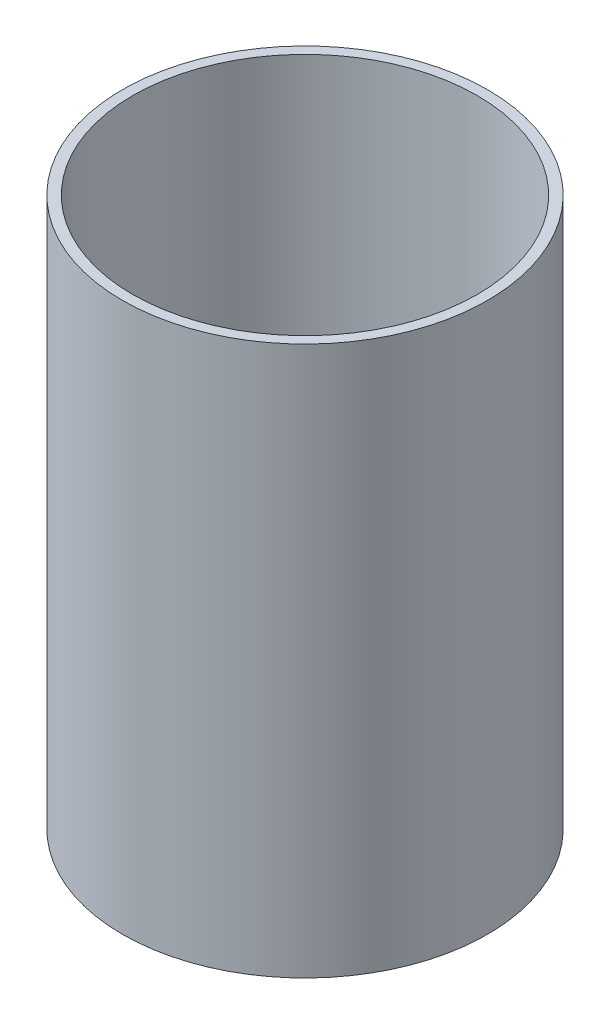
ISO-10303-21;
HEADER;
FILE_DESCRIPTION(('STEP AP214'),'2;1');
FILE_NAME('part.step','',(''),(''),'','','');
FILE_SCHEMA(('AUTOMOTIVE_DESIGN { 1 0 10303 214 1 1 1 1 }'));
ENDSEC;
DATA;
#1=APPLICATION_CONTEXT('core data for automotive mechanical design processes');
#2=APPLICATION_PROTOCOL_DEFINITION('international standard','automotive_design',2000,#1);
#3=PRODUCT_CONTEXT('',#1,'mechanical');
#4=PRODUCT('Part','Part','',(#3));
#5=PRODUCT_RELATED_PRODUCT_CATEGORY('part','',(#4));
#6=PRODUCT_DEFINITION_FORMATION('','',#4);
#7=PRODUCT_DEFINITION_CONTEXT('part definition',#1,'design');
#8=PRODUCT_DEFINITION('design','',#6,#7);
#9=PRODUCT_DEFINITION_SHAPE('','',#8);
#10=(LENGTH_UNIT() NAMED_UNIT(*) SI_UNIT(.MILLI.,.METRE.));
#11=(NAMED_UNIT(*) PLANE_ANGLE_UNIT() SI_UNIT($,.RADIAN.));
#12=(NAMED_UNIT(*) SI_UNIT($,.STERADIAN.) SOLID_ANGLE_UNIT());
#13=UNCERTAINTY_MEASURE_WITH_UNIT(LENGTH_MEASURE(1.E-05),#10,'distance_accuracy_value','');
#14=(GEOMETRIC_REPRESENTATION_CONTEXT(3) GLOBAL_UNCERTAINTY_ASSIGNED_CONTEXT((#13)) GLOBAL_UNIT_ASSIGNED_CONTEXT((#10,
#11,#12)) REPRESENTATION_CONTEXT('',''));
#15=CARTESIAN_POINT('',(0.,0.,0.));
#16=DIRECTION('',(0.,0.,1.));
#17=DIRECTION('',(1.,0.,0.));
#18=AXIS2_PLACEMENT_3D('',#15,#16,#17);
#19=CARTESIAN_POINT('',(0.,76.2,0.));
#20=DIRECTION('',(0.,1.,0.));
#21=DIRECTION('',(0.,0.,1.));
#22=AXIS2_PLACEMENT_3D('',#19,#20,#21);
#23=PLANE('',#22);
#24=CARTESIAN_POINT('',(0.,76.2,0.));
#25=DIRECTION('',(0.,1.,0.));
#26=DIRECTION('',(0.,0.,1.));
#27=AXIS2_PLACEMENT_3D('',#24,#25,#26);
#28=CIRCLE('',#27,25.3365);
#29=CARTESIAN_POINT('',(0.,76.2,25.3365));
#30=VERTEX_POINT('',#29);
#31=EDGE_CURVE('E10',#30,#30,#28,.T.);
#32=ORIENTED_EDGE('',*,*,#31,.T.);
#33=EDGE_LOOP('',(#32));
#34=FACE_BOUND('',#33,.T.);
#35=CARTESIAN_POINT('',(0.,76.2,0.));
#36=DIRECTION('',(0.,1.,0.));
#37=DIRECTION('',(0.,0.,1.));
#38=AXIS2_PLACEMENT_3D('',#35,#36,#37);
#39=CIRCLE('',#38,23.9141);
#40=CARTESIAN_POINT('',(0.,76.2,23.9141));
#41=VERTEX_POINT('',#40);
#42=EDGE_CURVE('E54',#41,#41,#39,.T.);
#43=ORIENTED_EDGE('',*,*,#42,.F.);
#44=EDGE_LOOP('',(#43));
#45=FACE_BOUND('',#44,.T.);
#46=ADVANCED_FACE('F41',(#34,#45),#23,.T.);
#47=CARTESIAN_POINT('',(0.,0.,0.));
#48=DIRECTION('',(0.,1.,0.));
#49=DIRECTION('',(0.,0.,1.));
#50=AXIS2_PLACEMENT_3D('',#47,#48,#49);
#51=PLANE('',#50);
#52=CARTESIAN_POINT('',(0.,0.,0.));
#53=DIRECTION('',(0.,1.,0.));
#54=DIRECTION('',(0.,0.,1.));
#55=AXIS2_PLACEMENT_3D('',#52,#53,#54);
#56=CIRCLE('',#55,25.3365);
#57=CARTESIAN_POINT('',(0.,0.,25.3365));
#58=VERTEX_POINT('',#57);
#59=EDGE_CURVE('E45',#58,#58,#56,.T.);
#60=ORIENTED_EDGE('',*,*,#59,.F.);
#61=EDGE_LOOP('',(#60));
#62=FACE_BOUND('',#61,.T.);
#63=CARTESIAN_POINT('',(0.,0.,0.));
#64=DIRECTION('',(0.,1.,0.));
#65=DIRECTION('',(0.,0.,1.));
#66=AXIS2_PLACEMENT_3D('',#63,#64,#65);
#67=CIRCLE('',#66,23.9141);
#68=CARTESIAN_POINT('',(0.,0.,23.9141));
#69=VERTEX_POINT('',#68);
#70=EDGE_CURVE('E56',#69,#69,#67,.T.);
#71=ORIENTED_EDGE('',*,*,#70,.T.);
#72=EDGE_LOOP('',(#71));
#73=FACE_BOUND('',#72,.T.);
#74=ADVANCED_FACE('F68',(#62,#73),#51,.F.);
#75=CARTESIAN_POINT('',(0.,76.2,0.));
#76=DIRECTION('',(0.,-1.,0.));
#77=DIRECTION('',(0.,0.,-1.));
#78=AXIS2_PLACEMENT_3D('',#75,#76,#77);
#79=CYLINDRICAL_SURFACE('',#78,25.3365);
#80=ORIENTED_EDGE('',*,*,#31,.F.);
#81=EDGE_LOOP('',(#80));
#82=FACE_BOUND('',#81,.T.);
#83=ORIENTED_EDGE('',*,*,#59,.T.);
#84=EDGE_LOOP('',(#83));
#85=FACE_BOUND('',#84,.T.);
#86=ADVANCED_FACE('F43',(#82,#85),#79,.T.);
#87=CARTESIAN_POINT('',(0.,76.2,0.));
#88=DIRECTION('',(0.,-1.,0.));
#89=DIRECTION('',(0.,0.,-1.));
#90=AXIS2_PLACEMENT_3D('',#87,#88,#89);
#91=CYLINDRICAL_SURFACE('',#90,23.9141);
#92=ORIENTED_EDGE('',*,*,#42,.T.);
#93=EDGE_LOOP('',(#92));
#94=FACE_BOUND('',#93,.T.);
#95=ORIENTED_EDGE('',*,*,#70,.F.);
#96=EDGE_LOOP('',(#95));
#97=FACE_BOUND('',#96,.T.);
#98=ADVANCED_FACE('F64',(#94,#97),#91,.F.);
#99=CLOSED_SHELL('',(#46,#74,#86,#98));
#100=MANIFOLD_SOLID_BREP('B2',#99);
#101=ADVANCED_BREP_SHAPE_REPRESENTATION('',(#18,#100),#14);
#102=SHAPE_DEFINITION_REPRESENTATION(#9,#101);
ENDSEC;
END-ISO-10303-21;
